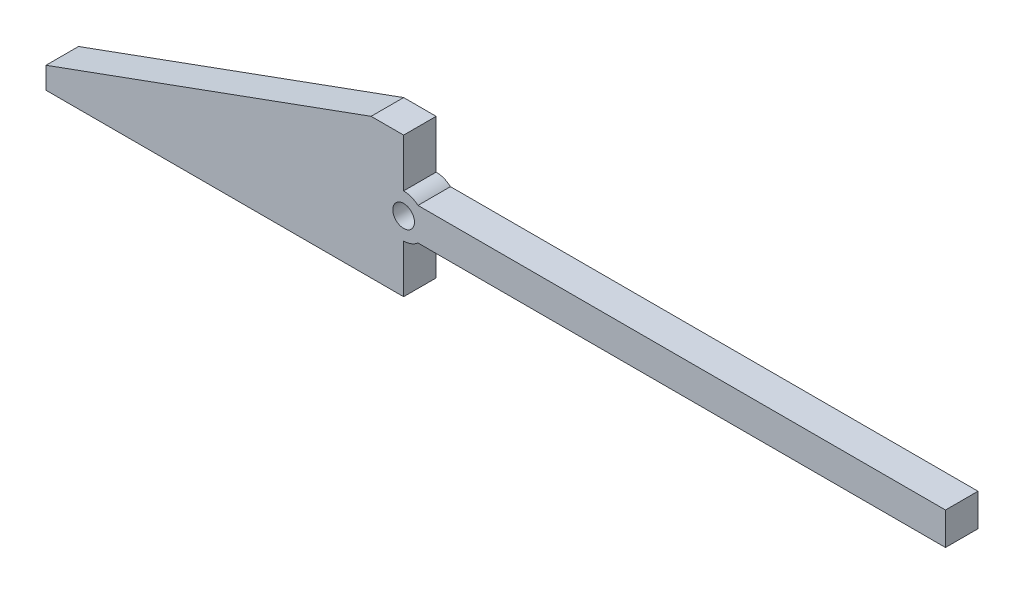
ISO-10303-21;
HEADER;
FILE_DESCRIPTION(('STEP AP214'),'2;1');
FILE_NAME('part.step','',(''),(''),'','','');
FILE_SCHEMA(('AUTOMOTIVE_DESIGN { 1 0 10303 214 1 1 1 1 }'));
ENDSEC;
DATA;
#1=APPLICATION_CONTEXT('core data for automotive mechanical design processes');
#2=APPLICATION_PROTOCOL_DEFINITION('international standard','automotive_design',2000,#1);
#3=PRODUCT_CONTEXT('',#1,'mechanical');
#4=PRODUCT('Part','Part','',(#3));
#5=PRODUCT_RELATED_PRODUCT_CATEGORY('part','',(#4));
#6=PRODUCT_DEFINITION_FORMATION('','',#4);
#7=PRODUCT_DEFINITION_CONTEXT('part definition',#1,'design');
#8=PRODUCT_DEFINITION('design','',#6,#7);
#9=PRODUCT_DEFINITION_SHAPE('','',#8);
#10=(LENGTH_UNIT() NAMED_UNIT(*) SI_UNIT(.MILLI.,.METRE.));
#11=(NAMED_UNIT(*) PLANE_ANGLE_UNIT() SI_UNIT($,.RADIAN.));
#12=(NAMED_UNIT(*) SI_UNIT($,.STERADIAN.) SOLID_ANGLE_UNIT());
#13=UNCERTAINTY_MEASURE_WITH_UNIT(LENGTH_MEASURE(1.E-05),#10,'distance_accuracy_value','');
#14=(GEOMETRIC_REPRESENTATION_CONTEXT(3) GLOBAL_UNCERTAINTY_ASSIGNED_CONTEXT((#13)) GLOBAL_UNIT_ASSIGNED_CONTEXT((#10,
#11,#12)) REPRESENTATION_CONTEXT('',''));
#15=CARTESIAN_POINT('',(0.,0.,0.));
#16=DIRECTION('',(0.,0.,1.));
#17=DIRECTION('',(1.,0.,0.));
#18=AXIS2_PLACEMENT_3D('',#15,#16,#17);
#19=CARTESIAN_POINT('',(33.,6.45955351399294,3.));
#20=DIRECTION('',(0.,0.,1.));
#21=DIRECTION('',(1.,0.,0.));
#22=AXIS2_PLACEMENT_3D('',#19,#20,#21);
#23=PLANE('',#22);
#24=DIRECTION('',(1.,0.,0.));
#25=VECTOR('',#24,1.);
#26=CARTESIAN_POINT('',(0.,0.,3.));
#27=LINE('',#26,#25);
#28=CARTESIAN_POINT('',(0.,0.,3.));
#29=VERTEX_POINT('',#28);
#30=CARTESIAN_POINT('',(33.,0.,3.));
#31=VERTEX_POINT('',#30);
#32=EDGE_CURVE('E197',#29,#31,#27,.T.);
#33=ORIENTED_EDGE('',*,*,#32,.T.);
#34=DIRECTION('',(0.,1.,0.));
#35=VECTOR('',#34,1.);
#36=CARTESIAN_POINT('',(33.,4.45955351399294,3.));
#37=LINE('',#36,#35);
#38=CARTESIAN_POINT('',(33.,4.45955351399294,3.));
#39=VERTEX_POINT('',#38);
#40=EDGE_CURVE('E115',#31,#39,#37,.T.);
#41=ORIENTED_EDGE('',*,*,#40,.T.);
#42=CARTESIAN_POINT('',(33.,6.45955351399294,3.));
#43=DIRECTION('',(0.,0.,1.));
#44=DIRECTION('',(1.,0.,0.));
#45=AXIS2_PLACEMENT_3D('',#42,#43,#44);
#46=CIRCLE('',#45,2.);
#47=CARTESIAN_POINT('',(34.3228756555323,4.95955351399294,3.));
#48=VERTEX_POINT('',#47);
#49=EDGE_CURVE('E230',#39,#48,#46,.T.);
#50=ORIENTED_EDGE('',*,*,#49,.T.);
#51=DIRECTION('',(1.,0.,0.));
#52=VECTOR('',#51,1.);
#53=CARTESIAN_POINT('',(83.,4.95955351399294,3.));
#54=LINE('',#53,#52);
#55=CARTESIAN_POINT('',(83.,4.95955351399294,3.));
#56=VERTEX_POINT('',#55);
#57=EDGE_CURVE('E250',#48,#56,#54,.T.);
#58=ORIENTED_EDGE('',*,*,#57,.T.);
#59=DIRECTION('',(0.,1.,0.));
#60=VECTOR('',#59,1.);
#61=CARTESIAN_POINT('',(83.,7.95955351399294,3.));
#62=LINE('',#61,#60);
#63=CARTESIAN_POINT('',(83.,7.95955351399294,3.));
#64=VERTEX_POINT('',#63);
#65=EDGE_CURVE('E246',#56,#64,#62,.T.);
#66=ORIENTED_EDGE('',*,*,#65,.T.);
#67=DIRECTION('',(-1.,0.,0.));
#68=VECTOR('',#67,1.);
#69=CARTESIAN_POINT('',(34.3228756555323,7.95955351399294,3.));
#70=LINE('',#69,#68);
#71=CARTESIAN_POINT('',(34.3228756555323,7.95955351399294,3.));
#72=VERTEX_POINT('',#71);
#73=EDGE_CURVE('E249',#64,#72,#70,.T.);
#74=ORIENTED_EDGE('',*,*,#73,.T.);
#75=CARTESIAN_POINT('',(33.,6.45955351399294,3.));
#76=DIRECTION('',(0.,0.,1.));
#77=DIRECTION('',(1.,0.,0.));
#78=AXIS2_PLACEMENT_3D('',#75,#76,#77);
#79=CIRCLE('',#78,2.);
#80=CARTESIAN_POINT('',(33.,8.45955351399295,3.));
#81=VERTEX_POINT('',#80);
#82=EDGE_CURVE('E254',#72,#81,#79,.T.);
#83=ORIENTED_EDGE('',*,*,#82,.T.);
#84=DIRECTION('',(0.,1.,0.));
#85=VECTOR('',#84,1.);
#86=CARTESIAN_POINT('',(33.,12.9191070279859,3.));
#87=LINE('',#86,#85);
#88=CARTESIAN_POINT('',(33.,12.9191070279859,3.));
#89=VERTEX_POINT('',#88);
#90=EDGE_CURVE('E143',#81,#89,#87,.T.);
#91=ORIENTED_EDGE('',*,*,#90,.T.);
#92=DIRECTION('',(-1.,0.,0.));
#93=VECTOR('',#92,1.);
#94=CARTESIAN_POINT('',(33.,12.9191070279859,3.));
#95=LINE('',#94,#93);
#96=CARTESIAN_POINT('',(30.,12.9191070279859,3.));
#97=VERTEX_POINT('',#96);
#98=EDGE_CURVE('E137',#89,#97,#95,.T.);
#99=ORIENTED_EDGE('',*,*,#98,.T.);
#100=DIRECTION('',(-0.93969262078591,-0.342020143325663,0.));
#101=VECTOR('',#100,1.);
#102=CARTESIAN_POINT('',(0.,2.,3.));
#103=LINE('',#102,#101);
#104=CARTESIAN_POINT('',(0.,2.,3.));
#105=VERTEX_POINT('',#104);
#106=EDGE_CURVE('E141',#97,#105,#103,.T.);
#107=ORIENTED_EDGE('',*,*,#106,.T.);
#108=DIRECTION('',(0.,-1.,0.));
#109=VECTOR('',#108,1.);
#110=CARTESIAN_POINT('',(0.,0.,3.));
#111=LINE('',#110,#109);
#112=EDGE_CURVE('E63',#105,#29,#111,.T.);
#113=ORIENTED_EDGE('',*,*,#112,.T.);
#114=EDGE_LOOP('',(#33,#41,#50,#58,#66,#74,#83,#91,#99,#107,#113));
#115=FACE_BOUND('',#114,.T.);
#116=CARTESIAN_POINT('',(33.,6.45955351399294,3.));
#117=DIRECTION('',(0.,0.,1.));
#118=DIRECTION('',(1.,0.,0.));
#119=AXIS2_PLACEMENT_3D('',#116,#117,#118);
#120=CIRCLE('',#119,0.999999999999998);
#121=CARTESIAN_POINT('',(34.,6.45955351399294,3.));
#122=VERTEX_POINT('',#121);
#123=EDGE_CURVE('E170',#122,#122,#120,.T.);
#124=ORIENTED_EDGE('',*,*,#123,.F.);
#125=EDGE_LOOP('',(#124));
#126=FACE_BOUND('',#125,.T.);
#127=ADVANCED_FACE('F45',(#115,#126),#23,.T.);
#128=CARTESIAN_POINT('',(33.,6.45955351399294,0.));
#129=DIRECTION('',(0.,0.,1.));
#130=DIRECTION('',(1.,0.,0.));
#131=AXIS2_PLACEMENT_3D('',#128,#129,#130);
#132=PLANE('',#131);
#133=DIRECTION('',(1.,0.,0.));
#134=VECTOR('',#133,1.);
#135=CARTESIAN_POINT('',(0.,0.,0.));
#136=LINE('',#135,#134);
#137=CARTESIAN_POINT('',(0.,0.,0.));
#138=VERTEX_POINT('',#137);
#139=CARTESIAN_POINT('',(33.,0.,0.));
#140=VERTEX_POINT('',#139);
#141=EDGE_CURVE('E165',#138,#140,#136,.T.);
#142=ORIENTED_EDGE('',*,*,#141,.F.);
#143=DIRECTION('',(0.,-1.,0.));
#144=VECTOR('',#143,1.);
#145=CARTESIAN_POINT('',(0.,0.,0.));
#146=LINE('',#145,#144);
#147=CARTESIAN_POINT('',(0.,2.,0.));
#148=VERTEX_POINT('',#147);
#149=EDGE_CURVE('E107',#148,#138,#146,.T.);
#150=ORIENTED_EDGE('',*,*,#149,.F.);
#151=DIRECTION('',(-0.93969262078591,-0.342020143325663,0.));
#152=VECTOR('',#151,1.);
#153=CARTESIAN_POINT('',(0.,2.,0.));
#154=LINE('',#153,#152);
#155=CARTESIAN_POINT('',(30.,12.9191070279859,0.));
#156=VERTEX_POINT('',#155);
#157=EDGE_CURVE('E101',#156,#148,#154,.T.);
#158=ORIENTED_EDGE('',*,*,#157,.F.);
#159=DIRECTION('',(-1.,0.,0.));
#160=VECTOR('',#159,1.);
#161=CARTESIAN_POINT('',(33.,12.9191070279859,0.));
#162=LINE('',#161,#160);
#163=CARTESIAN_POINT('',(33.,12.9191070279859,0.));
#164=VERTEX_POINT('',#163);
#165=EDGE_CURVE('E152',#164,#156,#162,.T.);
#166=ORIENTED_EDGE('',*,*,#165,.F.);
#167=DIRECTION('',(0.,1.,0.));
#168=VECTOR('',#167,1.);
#169=CARTESIAN_POINT('',(33.,12.9191070279859,0.));
#170=LINE('',#169,#168);
#171=CARTESIAN_POINT('',(33.,8.45955351399295,0.));
#172=VERTEX_POINT('',#171);
#173=EDGE_CURVE('E188',#172,#164,#170,.T.);
#174=ORIENTED_EDGE('',*,*,#173,.F.);
#175=CARTESIAN_POINT('',(33.,6.45955351399294,0.));
#176=DIRECTION('',(0.,0.,1.));
#177=DIRECTION('',(1.,0.,0.));
#178=AXIS2_PLACEMENT_3D('',#175,#176,#177);
#179=CIRCLE('',#178,2.);
#180=CARTESIAN_POINT('',(34.3228756555323,7.95955351399294,0.));
#181=VERTEX_POINT('',#180);
#182=EDGE_CURVE('E185',#181,#172,#179,.T.);
#183=ORIENTED_EDGE('',*,*,#182,.F.);
#184=DIRECTION('',(-1.,0.,0.));
#185=VECTOR('',#184,1.);
#186=CARTESIAN_POINT('',(34.3228756555323,7.95955351399294,0.));
#187=LINE('',#186,#185);
#188=CARTESIAN_POINT('',(83.,7.95955351399294,0.));
#189=VERTEX_POINT('',#188);
#190=EDGE_CURVE('E182',#189,#181,#187,.T.);
#191=ORIENTED_EDGE('',*,*,#190,.F.);
#192=DIRECTION('',(0.,1.,0.));
#193=VECTOR('',#192,1.);
#194=CARTESIAN_POINT('',(83.,7.95955351399294,0.));
#195=LINE('',#194,#193);
#196=CARTESIAN_POINT('',(83.,4.95955351399294,0.));
#197=VERTEX_POINT('',#196);
#198=EDGE_CURVE('E179',#197,#189,#195,.T.);
#199=ORIENTED_EDGE('',*,*,#198,.F.);
#200=DIRECTION('',(1.,0.,0.));
#201=VECTOR('',#200,1.);
#202=CARTESIAN_POINT('',(83.,4.95955351399294,0.));
#203=LINE('',#202,#201);
#204=CARTESIAN_POINT('',(34.3228756555323,4.95955351399294,0.));
#205=VERTEX_POINT('',#204);
#206=EDGE_CURVE('E176',#205,#197,#203,.T.);
#207=ORIENTED_EDGE('',*,*,#206,.F.);
#208=CARTESIAN_POINT('',(33.,6.45955351399294,0.));
#209=DIRECTION('',(0.,0.,1.));
#210=DIRECTION('',(1.,0.,0.));
#211=AXIS2_PLACEMENT_3D('',#208,#209,#210);
#212=CIRCLE('',#211,2.);
#213=CARTESIAN_POINT('',(33.,4.45955351399294,0.));
#214=VERTEX_POINT('',#213);
#215=EDGE_CURVE('E173',#214,#205,#212,.T.);
#216=ORIENTED_EDGE('',*,*,#215,.F.);
#217=DIRECTION('',(0.,1.,0.));
#218=VECTOR('',#217,1.);
#219=CARTESIAN_POINT('',(33.,4.45955351399294,0.));
#220=LINE('',#219,#218);
#221=EDGE_CURVE('E169',#140,#214,#220,.T.);
#222=ORIENTED_EDGE('',*,*,#221,.F.);
#223=EDGE_LOOP('',(#142,#150,#158,#166,#174,#183,#191,#199,#207,#216,#222));
#224=FACE_BOUND('',#223,.T.);
#225=CARTESIAN_POINT('',(33.,6.45955351399294,0.));
#226=DIRECTION('',(0.,0.,1.));
#227=DIRECTION('',(1.,0.,0.));
#228=AXIS2_PLACEMENT_3D('',#225,#226,#227);
#229=CIRCLE('',#228,0.999999999999998);
#230=CARTESIAN_POINT('',(34.,6.45955351399294,0.));
#231=VERTEX_POINT('',#230);
#232=EDGE_CURVE('E422',#231,#231,#229,.T.);
#233=ORIENTED_EDGE('',*,*,#232,.T.);
#234=EDGE_LOOP('',(#233));
#235=FACE_BOUND('',#234,.T.);
#236=ADVANCED_FACE('F234',(#224,#235),#132,.F.);
#237=CARTESIAN_POINT('',(0.,0.,3.));
#238=DIRECTION('',(0.,1.,0.));
#239=DIRECTION('',(0.,0.,1.));
#240=AXIS2_PLACEMENT_3D('',#237,#238,#239);
#241=PLANE('',#240);
#242=ORIENTED_EDGE('',*,*,#141,.T.);
#243=DIRECTION('',(0.,0.,-1.));
#244=VECTOR('',#243,1.);
#245=CARTESIAN_POINT('',(33.,0.,3.));
#246=LINE('',#245,#244);
#247=EDGE_CURVE('E11',#31,#140,#246,.T.);
#248=ORIENTED_EDGE('',*,*,#247,.F.);
#249=ORIENTED_EDGE('',*,*,#32,.F.);
#250=DIRECTION('',(0.,0.,-1.));
#251=VECTOR('',#250,1.);
#252=CARTESIAN_POINT('',(0.,0.,3.));
#253=LINE('',#252,#251);
#254=EDGE_CURVE('E161',#29,#138,#253,.T.);
#255=ORIENTED_EDGE('',*,*,#254,.T.);
#256=EDGE_LOOP('',(#242,#248,#249,#255));
#257=FACE_BOUND('',#256,.T.);
#258=ADVANCED_FACE('F47',(#257),#241,.F.);
#259=CARTESIAN_POINT('',(33.,4.45955351399294,3.));
#260=DIRECTION('',(-1.,0.,0.));
#261=DIRECTION('',(0.,0.,1.));
#262=AXIS2_PLACEMENT_3D('',#259,#260,#261);
#263=PLANE('',#262);
#264=ORIENTED_EDGE('',*,*,#221,.T.);
#265=DIRECTION('',(0.,0.,-1.));
#266=VECTOR('',#265,1.);
#267=CARTESIAN_POINT('',(33.,4.45955351399294,3.));
#268=LINE('',#267,#266);
#269=EDGE_CURVE('E55',#39,#214,#268,.T.);
#270=ORIENTED_EDGE('',*,*,#269,.F.);
#271=ORIENTED_EDGE('',*,*,#40,.F.);
#272=ORIENTED_EDGE('',*,*,#247,.T.);
#273=EDGE_LOOP('',(#264,#270,#271,#272));
#274=FACE_BOUND('',#273,.T.);
#275=ADVANCED_FACE('F293',(#274),#263,.F.);
#276=CARTESIAN_POINT('',(33.,6.45955351399294,3.));
#277=DIRECTION('',(0.,0.,-1.));
#278=DIRECTION('',(-1.,0.,0.));
#279=AXIS2_PLACEMENT_3D('',#276,#277,#278);
#280=CYLINDRICAL_SURFACE('',#279,2.);
#281=ORIENTED_EDGE('',*,*,#215,.T.);
#282=DIRECTION('',(0.,0.,-1.));
#283=VECTOR('',#282,1.);
#284=CARTESIAN_POINT('',(34.3228756555323,4.95955351399294,3.));
#285=LINE('',#284,#283);
#286=EDGE_CURVE('E220',#48,#205,#285,.T.);
#287=ORIENTED_EDGE('',*,*,#286,.F.);
#288=ORIENTED_EDGE('',*,*,#49,.F.);
#289=ORIENTED_EDGE('',*,*,#269,.T.);
#290=EDGE_LOOP('',(#281,#287,#288,#289));
#291=FACE_BOUND('',#290,.T.);
#292=ADVANCED_FACE('F228',(#291),#280,.T.);
#293=CARTESIAN_POINT('',(83.,4.95955351399294,3.));
#294=DIRECTION('',(0.,1.,0.));
#295=DIRECTION('',(0.,0.,1.));
#296=AXIS2_PLACEMENT_3D('',#293,#294,#295);
#297=PLANE('',#296);
#298=ORIENTED_EDGE('',*,*,#206,.T.);
#299=DIRECTION('',(0.,0.,-1.));
#300=VECTOR('',#299,1.);
#301=CARTESIAN_POINT('',(83.,4.95955351399294,3.));
#302=LINE('',#301,#300);
#303=EDGE_CURVE('E216',#56,#197,#302,.T.);
#304=ORIENTED_EDGE('',*,*,#303,.F.);
#305=ORIENTED_EDGE('',*,*,#57,.F.);
#306=ORIENTED_EDGE('',*,*,#286,.T.);
#307=EDGE_LOOP('',(#298,#304,#305,#306));
#308=FACE_BOUND('',#307,.T.);
#309=ADVANCED_FACE('F240',(#308),#297,.F.);
#310=CARTESIAN_POINT('',(83.,7.95955351399294,3.));
#311=DIRECTION('',(-1.,0.,0.));
#312=DIRECTION('',(0.,0.,1.));
#313=AXIS2_PLACEMENT_3D('',#310,#311,#312);
#314=PLANE('',#313);
#315=ORIENTED_EDGE('',*,*,#198,.T.);
#316=DIRECTION('',(0.,0.,-1.));
#317=VECTOR('',#316,1.);
#318=CARTESIAN_POINT('',(83.,7.95955351399294,3.));
#319=LINE('',#318,#317);
#320=EDGE_CURVE('E212',#64,#189,#319,.T.);
#321=ORIENTED_EDGE('',*,*,#320,.F.);
#322=ORIENTED_EDGE('',*,*,#65,.F.);
#323=ORIENTED_EDGE('',*,*,#303,.T.);
#324=EDGE_LOOP('',(#315,#321,#322,#323));
#325=FACE_BOUND('',#324,.T.);
#326=ADVANCED_FACE('F244',(#325),#314,.F.);
#327=CARTESIAN_POINT('',(34.3228756555323,7.95955351399294,3.));
#328=DIRECTION('',(0.,-1.,0.));
#329=DIRECTION('',(0.,0.,-1.));
#330=AXIS2_PLACEMENT_3D('',#327,#328,#329);
#331=PLANE('',#330);
#332=ORIENTED_EDGE('',*,*,#190,.T.);
#333=DIRECTION('',(0.,0.,-1.));
#334=VECTOR('',#333,1.);
#335=CARTESIAN_POINT('',(34.3228756555323,7.95955351399294,3.));
#336=LINE('',#335,#334);
#337=EDGE_CURVE('E208',#72,#181,#336,.T.);
#338=ORIENTED_EDGE('',*,*,#337,.F.);
#339=ORIENTED_EDGE('',*,*,#73,.F.);
#340=ORIENTED_EDGE('',*,*,#320,.T.);
#341=EDGE_LOOP('',(#332,#338,#339,#340));
#342=FACE_BOUND('',#341,.T.);
#343=ADVANCED_FACE('F306',(#342),#331,.F.);
#344=CARTESIAN_POINT('',(33.,6.45955351399294,3.));
#345=DIRECTION('',(0.,0.,-1.));
#346=DIRECTION('',(-1.,0.,0.));
#347=AXIS2_PLACEMENT_3D('',#344,#345,#346);
#348=CYLINDRICAL_SURFACE('',#347,2.);
#349=ORIENTED_EDGE('',*,*,#182,.T.);
#350=DIRECTION('',(0.,0.,-1.));
#351=VECTOR('',#350,1.);
#352=CARTESIAN_POINT('',(33.,8.45955351399295,3.));
#353=LINE('',#352,#351);
#354=EDGE_CURVE('E204',#81,#172,#353,.T.);
#355=ORIENTED_EDGE('',*,*,#354,.F.);
#356=ORIENTED_EDGE('',*,*,#82,.F.);
#357=ORIENTED_EDGE('',*,*,#337,.T.);
#358=EDGE_LOOP('',(#349,#355,#356,#357));
#359=FACE_BOUND('',#358,.T.);
#360=ADVANCED_FACE('F265',(#359),#348,.T.);
#361=CARTESIAN_POINT('',(33.,12.9191070279859,3.));
#362=DIRECTION('',(-1.,0.,0.));
#363=DIRECTION('',(0.,0.,1.));
#364=AXIS2_PLACEMENT_3D('',#361,#362,#363);
#365=PLANE('',#364);
#366=ORIENTED_EDGE('',*,*,#173,.T.);
#367=DIRECTION('',(0.,0.,-1.));
#368=VECTOR('',#367,1.);
#369=CARTESIAN_POINT('',(33.,12.9191070279859,3.));
#370=LINE('',#369,#368);
#371=EDGE_CURVE('E154',#89,#164,#370,.T.);
#372=ORIENTED_EDGE('',*,*,#371,.F.);
#373=ORIENTED_EDGE('',*,*,#90,.F.);
#374=ORIENTED_EDGE('',*,*,#354,.T.);
#375=EDGE_LOOP('',(#366,#372,#373,#374));
#376=FACE_BOUND('',#375,.T.);
#377=ADVANCED_FACE('F269',(#376),#365,.F.);
#378=CARTESIAN_POINT('',(33.,12.9191070279859,3.));
#379=DIRECTION('',(0.,-1.,0.));
#380=DIRECTION('',(0.,0.,-1.));
#381=AXIS2_PLACEMENT_3D('',#378,#379,#380);
#382=PLANE('',#381);
#383=ORIENTED_EDGE('',*,*,#165,.T.);
#384=DIRECTION('',(0.,0.,-1.));
#385=VECTOR('',#384,1.);
#386=CARTESIAN_POINT('',(30.,12.9191070279859,3.));
#387=LINE('',#386,#385);
#388=EDGE_CURVE('E149',#97,#156,#387,.T.);
#389=ORIENTED_EDGE('',*,*,#388,.F.);
#390=ORIENTED_EDGE('',*,*,#98,.F.);
#391=ORIENTED_EDGE('',*,*,#371,.T.);
#392=EDGE_LOOP('',(#383,#389,#390,#391));
#393=FACE_BOUND('',#392,.T.);
#394=ADVANCED_FACE('F150',(#393),#382,.F.);
#395=CARTESIAN_POINT('',(0.,2.,3.));
#396=DIRECTION('',(0.342020143325663,-0.93969262078591,0.));
#397=DIRECTION('',(0.93969262078591,0.342020143325663,0.));
#398=AXIS2_PLACEMENT_3D('',#395,#396,#397);
#399=PLANE('',#398);
#400=ORIENTED_EDGE('',*,*,#157,.T.);
#401=DIRECTION('',(0.,0.,-1.));
#402=VECTOR('',#401,1.);
#403=CARTESIAN_POINT('',(0.,2.,3.));
#404=LINE('',#403,#402);
#405=EDGE_CURVE('E155',#105,#148,#404,.T.);
#406=ORIENTED_EDGE('',*,*,#405,.F.);
#407=ORIENTED_EDGE('',*,*,#106,.F.);
#408=ORIENTED_EDGE('',*,*,#388,.T.);
#409=EDGE_LOOP('',(#400,#406,#407,#408));
#410=FACE_BOUND('',#409,.T.);
#411=ADVANCED_FACE('F157',(#410),#399,.F.);
#412=CARTESIAN_POINT('',(0.,0.,3.));
#413=DIRECTION('',(1.,0.,0.));
#414=DIRECTION('',(0.,0.,-1.));
#415=AXIS2_PLACEMENT_3D('',#412,#413,#414);
#416=PLANE('',#415);
#417=ORIENTED_EDGE('',*,*,#149,.T.);
#418=ORIENTED_EDGE('',*,*,#254,.F.);
#419=ORIENTED_EDGE('',*,*,#112,.F.);
#420=ORIENTED_EDGE('',*,*,#405,.T.);
#421=EDGE_LOOP('',(#417,#418,#419,#420));
#422=FACE_BOUND('',#421,.T.);
#423=ADVANCED_FACE('F273',(#422),#416,.F.);
#424=CARTESIAN_POINT('',(33.,6.45955351399294,3.));
#425=DIRECTION('',(0.,0.,-1.));
#426=DIRECTION('',(-1.,0.,0.));
#427=AXIS2_PLACEMENT_3D('',#424,#425,#426);
#428=CYLINDRICAL_SURFACE('',#427,0.999999999999998);
#429=ORIENTED_EDGE('',*,*,#123,.T.);
#430=EDGE_LOOP('',(#429));
#431=FACE_BOUND('',#430,.T.);
#432=ORIENTED_EDGE('',*,*,#232,.F.);
#433=EDGE_LOOP('',(#432));
#434=FACE_BOUND('',#433,.T.);
#435=ADVANCED_FACE('F275',(#431,#434),#428,.F.);
#436=CLOSED_SHELL('',(#127,#236,#258,#275,#292,#309,#326,#343,#360,#377,#394,#411,#423,#435));
#437=MANIFOLD_SOLID_BREP('B2',#436);
#438=ADVANCED_BREP_SHAPE_REPRESENTATION('',(#18,#437),#14);
#439=SHAPE_DEFINITION_REPRESENTATION(#9,#438);
ENDSEC;
END-ISO-10303-21;
